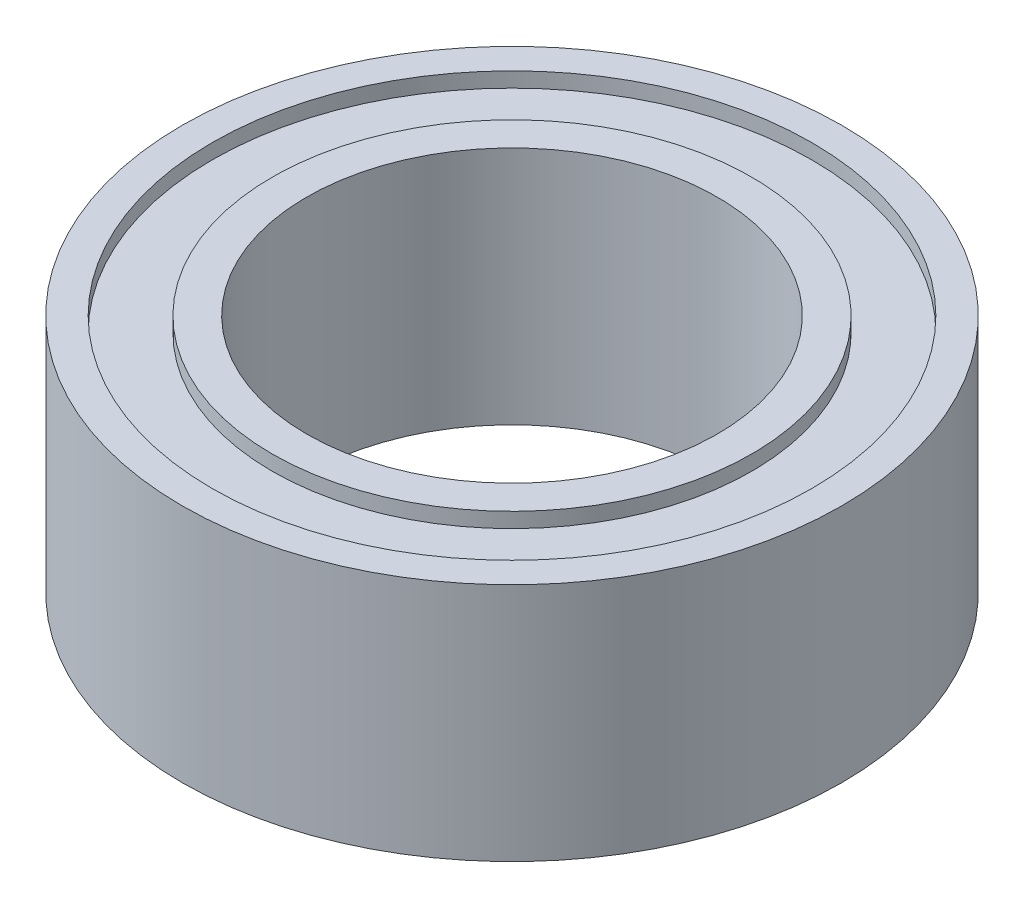
ISO-10303-21;
HEADER;
FILE_DESCRIPTION(('STEP AP214'),'2;1');
FILE_NAME('part.step','',(''),(''),'','','');
FILE_SCHEMA(('AUTOMOTIVE_DESIGN { 1 0 10303 214 1 1 1 1 }'));
ENDSEC;
DATA;
#1=APPLICATION_CONTEXT('core data for automotive mechanical design processes');
#2=APPLICATION_PROTOCOL_DEFINITION('international standard','automotive_design',2000,#1);
#3=PRODUCT_CONTEXT('',#1,'mechanical');
#4=PRODUCT('Part','Part','',(#3));
#5=PRODUCT_RELATED_PRODUCT_CATEGORY('part','',(#4));
#6=PRODUCT_DEFINITION_FORMATION('','',#4);
#7=PRODUCT_DEFINITION_CONTEXT('part definition',#1,'design');
#8=PRODUCT_DEFINITION('design','',#6,#7);
#9=PRODUCT_DEFINITION_SHAPE('','',#8);
#10=(LENGTH_UNIT() NAMED_UNIT(*) SI_UNIT(.MILLI.,.METRE.));
#11=(NAMED_UNIT(*) PLANE_ANGLE_UNIT() SI_UNIT($,.RADIAN.));
#12=(NAMED_UNIT(*) SI_UNIT($,.STERADIAN.) SOLID_ANGLE_UNIT());
#13=UNCERTAINTY_MEASURE_WITH_UNIT(LENGTH_MEASURE(1.E-05),#10,'distance_accuracy_value','');
#14=(GEOMETRIC_REPRESENTATION_CONTEXT(3) GLOBAL_UNCERTAINTY_ASSIGNED_CONTEXT((#13)) GLOBAL_UNIT_ASSIGNED_CONTEXT((#10,
#11,#12)) REPRESENTATION_CONTEXT('',''));
#15=CARTESIAN_POINT('',(0.,0.,0.));
#16=DIRECTION('',(0.,0.,1.));
#17=DIRECTION('',(1.,0.,0.));
#18=AXIS2_PLACEMENT_3D('',#15,#16,#17);
#19=CARTESIAN_POINT('',(0.,-4.,0.));
#20=DIRECTION('',(0.,1.,0.));
#21=DIRECTION('',(0.,0.,1.));
#22=AXIS2_PLACEMENT_3D('',#19,#20,#21);
#23=PLANE('',#22);
#24=CARTESIAN_POINT('',(0.,-4.,0.));
#25=DIRECTION('',(0.,1.,0.));
#26=DIRECTION('',(0.,0.,1.));
#27=AXIS2_PLACEMENT_3D('',#24,#25,#26);
#28=CIRCLE('',#27,6.85);
#29=CARTESIAN_POINT('',(0.,-4.,6.85));
#30=VERTEX_POINT('',#29);
#31=EDGE_CURVE('E35',#30,#30,#28,.T.);
#32=ORIENTED_EDGE('',*,*,#31,.T.);
#33=EDGE_LOOP('',(#32));
#34=FACE_BOUND('',#33,.T.);
#35=CARTESIAN_POINT('',(0.,-4.,0.));
#36=DIRECTION('',(0.,1.,0.));
#37=DIRECTION('',(0.,0.,1.));
#38=AXIS2_PLACEMENT_3D('',#35,#36,#37);
#39=CIRCLE('',#38,8.);
#40=CARTESIAN_POINT('',(0.,-4.,8.));
#41=VERTEX_POINT('',#40);
#42=EDGE_CURVE('E67',#41,#41,#39,.T.);
#43=ORIENTED_EDGE('',*,*,#42,.F.);
#44=EDGE_LOOP('',(#43));
#45=FACE_BOUND('',#44,.T.);
#46=ADVANCED_FACE('F31',(#34,#45),#23,.F.);
#47=CARTESIAN_POINT('',(0.,4.,0.));
#48=DIRECTION('',(0.,1.,0.));
#49=DIRECTION('',(0.,0.,1.));
#50=AXIS2_PLACEMENT_3D('',#47,#48,#49);
#51=PLANE('',#50);
#52=CARTESIAN_POINT('',(0.,4.,0.));
#53=DIRECTION('',(0.,1.,0.));
#54=DIRECTION('',(0.,0.,1.));
#55=AXIS2_PLACEMENT_3D('',#52,#53,#54);
#56=CIRCLE('',#55,6.85);
#57=CARTESIAN_POINT('',(0.,4.,6.85));
#58=VERTEX_POINT('',#57);
#59=EDGE_CURVE('E45',#58,#58,#56,.T.);
#60=ORIENTED_EDGE('',*,*,#59,.F.);
#61=EDGE_LOOP('',(#60));
#62=FACE_BOUND('',#61,.T.);
#63=CARTESIAN_POINT('',(0.,4.,0.));
#64=DIRECTION('',(0.,1.,0.));
#65=DIRECTION('',(0.,0.,1.));
#66=AXIS2_PLACEMENT_3D('',#63,#64,#65);
#67=CIRCLE('',#66,8.);
#68=CARTESIAN_POINT('',(0.,4.,8.));
#69=VERTEX_POINT('',#68);
#70=EDGE_CURVE('E55',#69,#69,#67,.T.);
#71=ORIENTED_EDGE('',*,*,#70,.T.);
#72=EDGE_LOOP('',(#71));
#73=FACE_BOUND('',#72,.T.);
#74=ADVANCED_FACE('F83',(#62,#73),#51,.T.);
#75=CARTESIAN_POINT('',(0.,4.,0.));
#76=DIRECTION('',(0.,-1.,0.));
#77=DIRECTION('',(0.,0.,-1.));
#78=AXIS2_PLACEMENT_3D('',#75,#76,#77);
#79=CYLINDRICAL_SURFACE('',#78,11.);
#80=CARTESIAN_POINT('',(0.,4.,0.));
#81=DIRECTION('',(0.,1.,0.));
#82=DIRECTION('',(0.,0.,1.));
#83=AXIS2_PLACEMENT_3D('',#80,#81,#82);
#84=CIRCLE('',#83,11.);
#85=CARTESIAN_POINT('',(0.,4.,11.));
#86=VERTEX_POINT('',#85);
#87=EDGE_CURVE('E10',#86,#86,#84,.T.);
#88=ORIENTED_EDGE('',*,*,#87,.F.);
#89=EDGE_LOOP('',(#88));
#90=FACE_BOUND('',#89,.T.);
#91=CARTESIAN_POINT('',(0.,-4.,0.));
#92=DIRECTION('',(0.,1.,0.));
#93=DIRECTION('',(0.,0.,1.));
#94=AXIS2_PLACEMENT_3D('',#91,#92,#93);
#95=CIRCLE('',#94,11.);
#96=CARTESIAN_POINT('',(0.,-4.,11.));
#97=VERTEX_POINT('',#96);
#98=EDGE_CURVE('E39',#97,#97,#95,.T.);
#99=ORIENTED_EDGE('',*,*,#98,.T.);
#100=EDGE_LOOP('',(#99));
#101=FACE_BOUND('',#100,.T.);
#102=ADVANCED_FACE('F33',(#90,#101),#79,.T.);
#103=CARTESIAN_POINT('',(0.,4.,0.));
#104=DIRECTION('',(0.,1.,0.));
#105=DIRECTION('',(0.,0.,1.));
#106=AXIS2_PLACEMENT_3D('',#103,#104,#105);
#107=CIRCLE('',#106,10.);
#108=CARTESIAN_POINT('',(0.,4.,10.));
#109=VERTEX_POINT('',#108);
#110=EDGE_CURVE('E49',#109,#109,#107,.T.);
#111=ORIENTED_EDGE('',*,*,#110,.F.);
#112=EDGE_LOOP('',(#111));
#113=FACE_BOUND('',#112,.T.);
#114=ORIENTED_EDGE('',*,*,#87,.T.);
#115=EDGE_LOOP('',(#114));
#116=FACE_BOUND('',#115,.T.);
#117=ADVANCED_FACE('F91',(#113,#116),#51,.T.);
#118=CARTESIAN_POINT('',(0.,-4.,0.));
#119=DIRECTION('',(0.,1.,0.));
#120=DIRECTION('',(0.,0.,1.));
#121=AXIS2_PLACEMENT_3D('',#118,#119,#120);
#122=CIRCLE('',#121,10.);
#123=CARTESIAN_POINT('',(0.,-4.,10.));
#124=VERTEX_POINT('',#123);
#125=EDGE_CURVE('E61',#124,#124,#122,.T.);
#126=ORIENTED_EDGE('',*,*,#125,.T.);
#127=EDGE_LOOP('',(#126));
#128=FACE_BOUND('',#127,.T.);
#129=ORIENTED_EDGE('',*,*,#98,.F.);
#130=EDGE_LOOP('',(#129));
#131=FACE_BOUND('',#130,.T.);
#132=ADVANCED_FACE('F85',(#128,#131),#23,.F.);
#133=CARTESIAN_POINT('',(0.,-7.96,0.));
#134=DIRECTION('',(0.,1.,0.));
#135=DIRECTION('',(0.,0.,1.));
#136=AXIS2_PLACEMENT_3D('',#133,#134,#135);
#137=CYLINDRICAL_SURFACE('',#136,6.85);
#138=ORIENTED_EDGE('',*,*,#59,.T.);
#139=EDGE_LOOP('',(#138));
#140=FACE_BOUND('',#139,.T.);
#141=ORIENTED_EDGE('',*,*,#31,.F.);
#142=EDGE_LOOP('',(#141));
#143=FACE_BOUND('',#142,.T.);
#144=ADVANCED_FACE('F94',(#140,#143),#137,.F.);
#145=CARTESIAN_POINT('',(0.,3.5,0.));
#146=DIRECTION('',(0.,1.,0.));
#147=DIRECTION('',(0.,0.,1.));
#148=AXIS2_PLACEMENT_3D('',#145,#146,#147);
#149=CYLINDRICAL_SURFACE('',#148,10.);
#150=CARTESIAN_POINT('',(0.,3.5,0.));
#151=DIRECTION('',(0.,1.,0.));
#152=DIRECTION('',(0.,0.,1.));
#153=AXIS2_PLACEMENT_3D('',#150,#151,#152);
#154=CIRCLE('',#153,10.);
#155=CARTESIAN_POINT('',(0.,3.5,10.));
#156=VERTEX_POINT('',#155);
#157=EDGE_CURVE('E48',#156,#156,#154,.T.);
#158=ORIENTED_EDGE('',*,*,#157,.F.);
#159=EDGE_LOOP('',(#158));
#160=FACE_BOUND('',#159,.T.);
#161=ORIENTED_EDGE('',*,*,#110,.T.);
#162=EDGE_LOOP('',(#161));
#163=FACE_BOUND('',#162,.T.);
#164=ADVANCED_FACE('F100',(#160,#163),#149,.F.);
#165=CARTESIAN_POINT('',(0.,3.5,0.));
#166=DIRECTION('',(0.,1.,0.));
#167=DIRECTION('',(0.,0.,1.));
#168=AXIS2_PLACEMENT_3D('',#165,#166,#167);
#169=PLANE('',#168);
#170=CARTESIAN_POINT('',(0.,3.5,0.));
#171=DIRECTION('',(0.,1.,0.));
#172=DIRECTION('',(0.,0.,1.));
#173=AXIS2_PLACEMENT_3D('',#170,#171,#172);
#174=CIRCLE('',#173,8.);
#175=CARTESIAN_POINT('',(0.,3.5,8.));
#176=VERTEX_POINT('',#175);
#177=EDGE_CURVE('E52',#176,#176,#174,.T.);
#178=ORIENTED_EDGE('',*,*,#177,.F.);
#179=EDGE_LOOP('',(#178));
#180=FACE_BOUND('',#179,.T.);
#181=ORIENTED_EDGE('',*,*,#157,.T.);
#182=EDGE_LOOP('',(#181));
#183=FACE_BOUND('',#182,.T.);
#184=ADVANCED_FACE('F131',(#180,#183),#169,.T.);
#185=CARTESIAN_POINT('',(0.,3.5,0.));
#186=DIRECTION('',(0.,1.,0.));
#187=DIRECTION('',(0.,0.,1.));
#188=AXIS2_PLACEMENT_3D('',#185,#186,#187);
#189=CYLINDRICAL_SURFACE('',#188,8.);
#190=ORIENTED_EDGE('',*,*,#177,.T.);
#191=EDGE_LOOP('',(#190));
#192=FACE_BOUND('',#191,.T.);
#193=ORIENTED_EDGE('',*,*,#70,.F.);
#194=EDGE_LOOP('',(#193));
#195=FACE_BOUND('',#194,.T.);
#196=ADVANCED_FACE('F141',(#192,#195),#189,.T.);
#197=CARTESIAN_POINT('',(0.,-3.5,0.));
#198=DIRECTION('',(0.,-1.,0.));
#199=DIRECTION('',(0.,0.,1.));
#200=AXIS2_PLACEMENT_3D('',#197,#198,#199);
#201=PLANE('',#200);
#202=CARTESIAN_POINT('',(0.,-3.5,0.));
#203=DIRECTION('',(0.,1.,0.));
#204=DIRECTION('',(0.,0.,1.));
#205=AXIS2_PLACEMENT_3D('',#202,#203,#204);
#206=CIRCLE('',#205,10.);
#207=CARTESIAN_POINT('',(0.,-3.5,10.));
#208=VERTEX_POINT('',#207);
#209=EDGE_CURVE('E58',#208,#208,#206,.T.);
#210=ORIENTED_EDGE('',*,*,#209,.F.);
#211=EDGE_LOOP('',(#210));
#212=FACE_BOUND('',#211,.T.);
#213=CARTESIAN_POINT('',(0.,-3.5,0.));
#214=DIRECTION('',(0.,1.,0.));
#215=DIRECTION('',(0.,0.,1.));
#216=AXIS2_PLACEMENT_3D('',#213,#214,#215);
#217=CIRCLE('',#216,8.);
#218=CARTESIAN_POINT('',(0.,-3.5,8.));
#219=VERTEX_POINT('',#218);
#220=EDGE_CURVE('E64',#219,#219,#217,.T.);
#221=ORIENTED_EDGE('',*,*,#220,.T.);
#222=EDGE_LOOP('',(#221));
#223=FACE_BOUND('',#222,.T.);
#224=ADVANCED_FACE('F73',(#212,#223),#201,.T.);
#225=CARTESIAN_POINT('',(0.,-3.5,0.));
#226=DIRECTION('',(0.,-1.,0.));
#227=DIRECTION('',(0.,0.,-1.));
#228=AXIS2_PLACEMENT_3D('',#225,#226,#227);
#229=CYLINDRICAL_SURFACE('',#228,10.);
#230=ORIENTED_EDGE('',*,*,#209,.T.);
#231=EDGE_LOOP('',(#230));
#232=FACE_BOUND('',#231,.T.);
#233=ORIENTED_EDGE('',*,*,#125,.F.);
#234=EDGE_LOOP('',(#233));
#235=FACE_BOUND('',#234,.T.);
#236=ADVANCED_FACE('F78',(#232,#235),#229,.F.);
#237=CARTESIAN_POINT('',(0.,-3.5,0.));
#238=DIRECTION('',(0.,-1.,0.));
#239=DIRECTION('',(0.,0.,-1.));
#240=AXIS2_PLACEMENT_3D('',#237,#238,#239);
#241=CYLINDRICAL_SURFACE('',#240,8.);
#242=ORIENTED_EDGE('',*,*,#220,.F.);
#243=EDGE_LOOP('',(#242));
#244=FACE_BOUND('',#243,.T.);
#245=ORIENTED_EDGE('',*,*,#42,.T.);
#246=EDGE_LOOP('',(#245));
#247=FACE_BOUND('',#246,.T.);
#248=ADVANCED_FACE('F75',(#244,#247),#241,.T.);
#249=CLOSED_SHELL('',(#46,#74,#102,#117,#132,#144,#164,#184,#196,#224,#236,#248));
#250=MANIFOLD_SOLID_BREP('B2',#249);
#251=ADVANCED_BREP_SHAPE_REPRESENTATION('',(#18,#250),#14);
#252=SHAPE_DEFINITION_REPRESENTATION(#9,#251);
ENDSEC;
END-ISO-10303-21;
